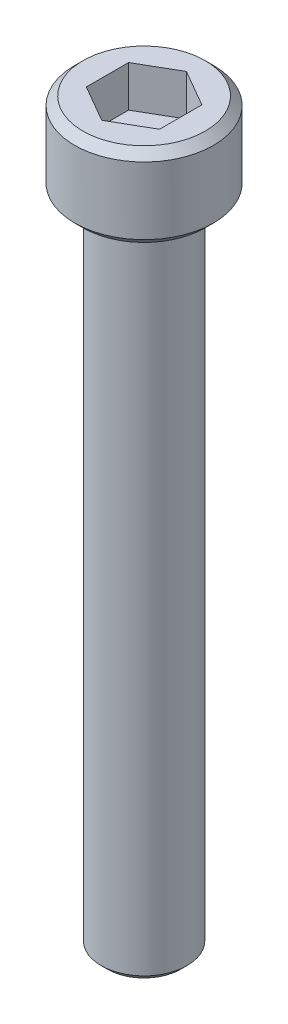
ISO-10303-21;
HEADER;
FILE_DESCRIPTION(('STEP AP214'),'2;1');
FILE_NAME('part.step','',(''),(''),'','','');
FILE_SCHEMA(('AUTOMOTIVE_DESIGN { 1 0 10303 214 1 1 1 1 }'));
ENDSEC;
DATA;
#1=APPLICATION_CONTEXT('core data for automotive mechanical design processes');
#2=APPLICATION_PROTOCOL_DEFINITION('international standard','automotive_design',2000,#1);
#3=PRODUCT_CONTEXT('',#1,'mechanical');
#4=PRODUCT('Part','Part','',(#3));
#5=PRODUCT_RELATED_PRODUCT_CATEGORY('part','',(#4));
#6=PRODUCT_DEFINITION_FORMATION('','',#4);
#7=PRODUCT_DEFINITION_CONTEXT('part definition',#1,'design');
#8=PRODUCT_DEFINITION('design','',#6,#7);
#9=PRODUCT_DEFINITION_SHAPE('','',#8);
#10=(LENGTH_UNIT() NAMED_UNIT(*) SI_UNIT(.MILLI.,.METRE.));
#11=(NAMED_UNIT(*) PLANE_ANGLE_UNIT() SI_UNIT($,.RADIAN.));
#12=(NAMED_UNIT(*) SI_UNIT($,.STERADIAN.) SOLID_ANGLE_UNIT());
#13=UNCERTAINTY_MEASURE_WITH_UNIT(LENGTH_MEASURE(1.E-05),#10,'distance_accuracy_value','');
#14=(GEOMETRIC_REPRESENTATION_CONTEXT(3) GLOBAL_UNCERTAINTY_ASSIGNED_CONTEXT((#13)) GLOBAL_UNIT_ASSIGNED_CONTEXT((#10,
#11,#12)) REPRESENTATION_CONTEXT('',''));
#15=CARTESIAN_POINT('',(0.,0.,0.));
#16=DIRECTION('',(0.,0.,1.));
#17=DIRECTION('',(1.,0.,0.));
#18=AXIS2_PLACEMENT_3D('',#15,#16,#17);
#19=CARTESIAN_POINT('',(1.778,2.06399999999999,3.07958633585746));
#20=DIRECTION('',(0.,1.,0.));
#21=DIRECTION('',(0.,0.,1.));
#22=AXIS2_PLACEMENT_3D('',#19,#20,#21);
#23=PLANE('',#22);
#24=DIRECTION('',(-0.866025403784439,0.,0.5));
#25=VECTOR('',#24,1.);
#26=CARTESIAN_POINT('',(0.,2.064,-2.05305755723831));
#27=LINE('',#26,#25);
#28=CARTESIAN_POINT('',(0.,2.06399999999999,-2.05305755723831));
#29=VERTEX_POINT('',#28);
#30=CARTESIAN_POINT('',(-1.778,2.06399999999999,-1.02652877861915));
#31=VERTEX_POINT('',#30);
#32=EDGE_CURVE('E68',#29,#31,#27,.T.);
#33=ORIENTED_EDGE('',*,*,#32,.T.);
#34=DIRECTION('',(0.,0.,1.));
#35=VECTOR('',#34,1.);
#36=CARTESIAN_POINT('',(-1.778,2.064,-1.02652877861915));
#37=LINE('',#36,#35);
#38=CARTESIAN_POINT('',(-1.778,2.06399999999999,1.02652877861915));
#39=VERTEX_POINT('',#38);
#40=EDGE_CURVE('E70',#31,#39,#37,.T.);
#41=ORIENTED_EDGE('',*,*,#40,.T.);
#42=DIRECTION('',(0.866025403784439,0.,0.499999999999999));
#43=VECTOR('',#42,1.);
#44=CARTESIAN_POINT('',(-1.778,2.064,1.02652877861915));
#45=LINE('',#44,#43);
#46=CARTESIAN_POINT('',(0.,2.06399999999999,2.05305755723831));
#47=VERTEX_POINT('',#46);
#48=EDGE_CURVE('E72',#39,#47,#45,.T.);
#49=ORIENTED_EDGE('',*,*,#48,.T.);
#50=DIRECTION('',(0.866025403784438,0.,-0.500000000000001));
#51=VECTOR('',#50,1.);
#52=CARTESIAN_POINT('',(0.,2.064,2.0530575572383));
#53=LINE('',#52,#51);
#54=CARTESIAN_POINT('',(1.778,2.06399999999999,1.02652877861915));
#55=VERTEX_POINT('',#54);
#56=EDGE_CURVE('E127',#47,#55,#53,.T.);
#57=ORIENTED_EDGE('',*,*,#56,.T.);
#58=DIRECTION('',(0.,0.,-1.));
#59=VECTOR('',#58,1.);
#60=CARTESIAN_POINT('',(1.778,2.06399999999999,1.02652877861915));
#61=LINE('',#60,#59);
#62=CARTESIAN_POINT('',(1.778,2.06399999999999,-1.02652877861916));
#63=VERTEX_POINT('',#62);
#64=EDGE_CURVE('E132',#55,#63,#61,.T.);
#65=ORIENTED_EDGE('',*,*,#64,.T.);
#66=DIRECTION('',(-0.866025403784439,0.,-0.499999999999999));
#67=VECTOR('',#66,1.);
#68=CARTESIAN_POINT('',(1.778,2.06399999999999,-1.02652877861916));
#69=LINE('',#68,#67);
#70=EDGE_CURVE('E136',#63,#29,#69,.T.);
#71=ORIENTED_EDGE('',*,*,#70,.T.);
#72=EDGE_LOOP('',(#33,#41,#49,#57,#65,#71));
#73=FACE_BOUND('',#72,.T.);
#74=ADVANCED_FACE('F17',(#73),#23,.T.);
#75=CARTESIAN_POINT('',(-1.778,2.064,1.02652877861915));
#76=DIRECTION('',(-0.499999999999999,0.,0.866025403784439));
#77=DIRECTION('',(0.866025403784439,0.,0.499999999999999));
#78=AXIS2_PLACEMENT_3D('',#75,#76,#77);
#79=PLANE('',#78);
#80=DIRECTION('',(0.,1.,0.));
#81=VECTOR('',#80,1.);
#82=CARTESIAN_POINT('',(0.,2.064,2.0530575572383));
#83=LINE('',#82,#81);
#84=CARTESIAN_POINT('',(0.,4.064,2.05305755723831));
#85=VERTEX_POINT('',#84);
#86=EDGE_CURVE('E83',#85,#47,#83,.F.);
#87=ORIENTED_EDGE('',*,*,#86,.T.);
#88=ORIENTED_EDGE('',*,*,#48,.F.);
#89=DIRECTION('',(0.,1.,0.));
#90=VECTOR('',#89,1.);
#91=CARTESIAN_POINT('',(-1.778,2.064,1.02652877861915));
#92=LINE('',#91,#90);
#93=CARTESIAN_POINT('',(-1.778,4.064,1.02652877861915));
#94=VERTEX_POINT('',#93);
#95=EDGE_CURVE('E77',#39,#94,#92,.T.);
#96=ORIENTED_EDGE('',*,*,#95,.T.);
#97=DIRECTION('',(-0.86602540378444,0.,-0.499999999999997));
#98=VECTOR('',#97,1.);
#99=CARTESIAN_POINT('',(0.,4.064,2.0530575572383));
#100=LINE('',#99,#98);
#101=EDGE_CURVE('E124',#85,#94,#100,.T.);
#102=ORIENTED_EDGE('',*,*,#101,.F.);
#103=EDGE_LOOP('',(#87,#88,#96,#102));
#104=FACE_BOUND('',#103,.T.);
#105=ADVANCED_FACE('F80',(#104),#79,.F.);
#106=CARTESIAN_POINT('',(-1.778,2.064,-1.02652877861915));
#107=DIRECTION('',(-1.,0.,0.));
#108=DIRECTION('',(0.,0.,1.));
#109=AXIS2_PLACEMENT_3D('',#106,#107,#108);
#110=PLANE('',#109);
#111=ORIENTED_EDGE('',*,*,#95,.F.);
#112=ORIENTED_EDGE('',*,*,#40,.F.);
#113=DIRECTION('',(0.,1.,0.));
#114=VECTOR('',#113,1.);
#115=CARTESIAN_POINT('',(-1.778,2.064,-1.02652877861915));
#116=LINE('',#115,#114);
#117=CARTESIAN_POINT('',(-1.778,4.064,-1.02652877861915));
#118=VERTEX_POINT('',#117);
#119=EDGE_CURVE('E91',#31,#118,#116,.T.);
#120=ORIENTED_EDGE('',*,*,#119,.T.);
#121=DIRECTION('',(0.,0.,1.));
#122=VECTOR('',#121,1.);
#123=CARTESIAN_POINT('',(-1.778,4.064,0.));
#124=LINE('',#123,#122);
#125=EDGE_CURVE('E88',#94,#118,#124,.F.);
#126=ORIENTED_EDGE('',*,*,#125,.F.);
#127=EDGE_LOOP('',(#111,#112,#120,#126));
#128=FACE_BOUND('',#127,.T.);
#129=ADVANCED_FACE('F86',(#128),#110,.F.);
#130=CARTESIAN_POINT('',(0.,2.064,-2.05305755723831));
#131=DIRECTION('',(-0.5,0.,-0.866025403784439));
#132=DIRECTION('',(-0.866025403784439,0.,0.5));
#133=AXIS2_PLACEMENT_3D('',#130,#131,#132);
#134=PLANE('',#133);
#135=ORIENTED_EDGE('',*,*,#119,.F.);
#136=ORIENTED_EDGE('',*,*,#32,.F.);
#137=DIRECTION('',(0.,1.,0.));
#138=VECTOR('',#137,1.);
#139=CARTESIAN_POINT('',(0.,2.06399999999999,-2.05305755723831));
#140=LINE('',#139,#138);
#141=CARTESIAN_POINT('',(0.,4.064,-2.05305755723831));
#142=VERTEX_POINT('',#141);
#143=EDGE_CURVE('E134',#29,#142,#140,.T.);
#144=ORIENTED_EDGE('',*,*,#143,.T.);
#145=DIRECTION('',(0.866025403784439,0.,-0.499999999999999));
#146=VECTOR('',#145,1.);
#147=CARTESIAN_POINT('',(-1.778,4.064,-1.02652877861915));
#148=LINE('',#147,#146);
#149=EDGE_CURVE('E120',#118,#142,#148,.T.);
#150=ORIENTED_EDGE('',*,*,#149,.F.);
#151=EDGE_LOOP('',(#135,#136,#144,#150));
#152=FACE_BOUND('',#151,.T.);
#153=ADVANCED_FACE('F139',(#152),#134,.F.);
#154=CARTESIAN_POINT('',(1.778,2.06399999999999,-1.02652877861916));
#155=DIRECTION('',(0.499999999999999,0.,-0.866025403784439));
#156=DIRECTION('',(-0.866025403784439,0.,-0.499999999999999));
#157=AXIS2_PLACEMENT_3D('',#154,#155,#156);
#158=PLANE('',#157);
#159=ORIENTED_EDGE('',*,*,#143,.F.);
#160=ORIENTED_EDGE('',*,*,#70,.F.);
#161=DIRECTION('',(0.,1.,0.));
#162=VECTOR('',#161,1.);
#163=CARTESIAN_POINT('',(1.778,2.06399999999999,-1.02652877861916));
#164=LINE('',#163,#162);
#165=CARTESIAN_POINT('',(1.778,4.064,-1.02652877861916));
#166=VERTEX_POINT('',#165);
#167=EDGE_CURVE('E130',#63,#166,#164,.T.);
#168=ORIENTED_EDGE('',*,*,#167,.T.);
#169=DIRECTION('',(0.86602540378444,0.,0.499999999999998));
#170=VECTOR('',#169,1.);
#171=CARTESIAN_POINT('',(0.,4.064,-2.05305755723831));
#172=LINE('',#171,#170);
#173=EDGE_CURVE('E117',#142,#166,#172,.T.);
#174=ORIENTED_EDGE('',*,*,#173,.F.);
#175=EDGE_LOOP('',(#159,#160,#168,#174));
#176=FACE_BOUND('',#175,.T.);
#177=ADVANCED_FACE('F151',(#176),#158,.F.);
#178=CARTESIAN_POINT('',(1.778,2.06399999999999,1.02652877861915));
#179=DIRECTION('',(1.,0.,0.));
#180=DIRECTION('',(0.,0.,-1.));
#181=AXIS2_PLACEMENT_3D('',#178,#179,#180);
#182=PLANE('',#181);
#183=ORIENTED_EDGE('',*,*,#167,.F.);
#184=ORIENTED_EDGE('',*,*,#64,.F.);
#185=DIRECTION('',(0.,1.,0.));
#186=VECTOR('',#185,1.);
#187=CARTESIAN_POINT('',(1.778,2.064,1.02652877861915));
#188=LINE('',#187,#186);
#189=CARTESIAN_POINT('',(1.778,4.06399999999999,1.02652877861915));
#190=VERTEX_POINT('',#189);
#191=EDGE_CURVE('E35',#55,#190,#188,.T.);
#192=ORIENTED_EDGE('',*,*,#191,.T.);
#193=DIRECTION('',(0.,0.,1.));
#194=VECTOR('',#193,1.);
#195=CARTESIAN_POINT('',(1.778,4.064,0.));
#196=LINE('',#195,#194);
#197=EDGE_CURVE('E114',#166,#190,#196,.T.);
#198=ORIENTED_EDGE('',*,*,#197,.F.);
#199=EDGE_LOOP('',(#183,#184,#192,#198));
#200=FACE_BOUND('',#199,.T.);
#201=ADVANCED_FACE('F149',(#200),#182,.F.);
#202=CARTESIAN_POINT('',(0.,2.064,2.0530575572383));
#203=DIRECTION('',(0.500000000000001,0.,0.866025403784438));
#204=DIRECTION('',(0.866025403784438,0.,-0.500000000000001));
#205=AXIS2_PLACEMENT_3D('',#202,#203,#204);
#206=PLANE('',#205);
#207=ORIENTED_EDGE('',*,*,#191,.F.);
#208=ORIENTED_EDGE('',*,*,#56,.F.);
#209=ORIENTED_EDGE('',*,*,#86,.F.);
#210=DIRECTION('',(-0.866025403784439,0.,0.5));
#211=VECTOR('',#210,1.);
#212=CARTESIAN_POINT('',(1.778,4.064,1.02652877861915));
#213=LINE('',#212,#211);
#214=EDGE_CURVE('E111',#190,#85,#213,.T.);
#215=ORIENTED_EDGE('',*,*,#214,.F.);
#216=EDGE_LOOP('',(#207,#208,#209,#215));
#217=FACE_BOUND('',#216,.T.);
#218=ADVANCED_FACE('F146',(#217),#206,.F.);
#219=CARTESIAN_POINT('',(0.,4.064,0.));
#220=DIRECTION('',(0.,1.,0.));
#221=DIRECTION('',(0.,0.,1.));
#222=AXIS2_PLACEMENT_3D('',#219,#220,#221);
#223=PLANE('',#222);
#224=ORIENTED_EDGE('',*,*,#197,.T.);
#225=ORIENTED_EDGE('',*,*,#214,.T.);
#226=ORIENTED_EDGE('',*,*,#101,.T.);
#227=ORIENTED_EDGE('',*,*,#125,.T.);
#228=ORIENTED_EDGE('',*,*,#149,.T.);
#229=ORIENTED_EDGE('',*,*,#173,.T.);
#230=EDGE_LOOP('',(#224,#225,#226,#227,#228,#229));
#231=FACE_BOUND('',#230,.T.);
#232=CARTESIAN_POINT('',(0.,4.06400000002805,0.));
#233=DIRECTION('',(0.,-1.,0.));
#234=DIRECTION('',(1.,0.,0.));
#235=AXIS2_PLACEMENT_3D('',#232,#233,#234);
#236=CIRCLE('',#235,2.96550000001616);
#237=CARTESIAN_POINT('',(2.96550000001616,4.06400000002805,0.));
#238=VERTEX_POINT('',#237);
#239=EDGE_CURVE('E20',#238,#238,#236,.T.);
#240=ORIENTED_EDGE('',*,*,#239,.F.);
#241=EDGE_LOOP('',(#240));
#242=FACE_BOUND('',#241,.T.);
#243=ADVANCED_FACE('F143',(#231,#242),#223,.T.);
#244=CARTESIAN_POINT('',(0.,3.66400000007161,0.));
#245=DIRECTION('',(0.,-1.,0.));
#246=DIRECTION('',(1.,0.,0.));
#247=AXIS2_PLACEMENT_3D('',#244,#245,#246);
#248=CONICAL_SURFACE('',#247,3.36550000002944,0.785398163468503);
#249=ORIENTED_EDGE('',*,*,#239,.T.);
#250=EDGE_LOOP('',(#249));
#251=FACE_BOUND('',#250,.T.);
#252=CARTESIAN_POINT('',(0.,3.66399999999999,0.));
#253=DIRECTION('',(0.,-1.,0.));
#254=DIRECTION('',(0.,0.,-1.));
#255=AXIS2_PLACEMENT_3D('',#252,#253,#254);
#256=CIRCLE('',#255,3.3655);
#257=CARTESIAN_POINT('',(0.,3.66399999999999,-3.3655));
#258=VERTEX_POINT('',#257);
#259=EDGE_CURVE('E103',#258,#258,#256,.T.);
#260=ORIENTED_EDGE('',*,*,#259,.F.);
#261=EDGE_LOOP('',(#260));
#262=FACE_BOUND('',#261,.T.);
#263=ADVANCED_FACE('F188',(#251,#262),#248,.T.);
#264=CARTESIAN_POINT('',(0.,4.064,0.));
#265=DIRECTION('',(0.,-1.,0.));
#266=DIRECTION('',(0.,0.,-1.));
#267=AXIS2_PLACEMENT_3D('',#264,#265,#266);
#268=CYLINDRICAL_SURFACE('',#267,3.3655);
#269=ORIENTED_EDGE('',*,*,#259,.T.);
#270=EDGE_LOOP('',(#269));
#271=FACE_BOUND('',#270,.T.);
#272=CARTESIAN_POINT('',(0.,0.400000000013279,0.));
#273=DIRECTION('',(0.,1.,0.));
#274=DIRECTION('',(0.,0.,1.));
#275=AXIS2_PLACEMENT_3D('',#272,#273,#274);
#276=CIRCLE('',#275,3.3654999999726);
#277=CARTESIAN_POINT('',(0.,0.400000000013279,3.3654999999726));
#278=VERTEX_POINT('',#277);
#279=EDGE_CURVE('E99',#278,#278,#276,.F.);
#280=ORIENTED_EDGE('',*,*,#279,.F.);
#281=EDGE_LOOP('',(#280));
#282=FACE_BOUND('',#281,.T.);
#283=ADVANCED_FACE('F184',(#271,#282),#268,.T.);
#284=CARTESIAN_POINT('',(0.,-31.75,0.));
#285=DIRECTION('',(0.,1.,0.));
#286=DIRECTION('',(0.,0.,1.));
#287=AXIS2_PLACEMENT_3D('',#284,#285,#286);
#288=PLANE('',#287);
#289=CARTESIAN_POINT('',(0.,-31.7499999999882,0.));
#290=DIRECTION('',(0.,1.,0.));
#291=DIRECTION('',(0.,0.,1.));
#292=AXIS2_PLACEMENT_3D('',#289,#290,#291);
#293=CIRCLE('',#292,1.78280000000086);
#294=CARTESIAN_POINT('',(0.,-31.7499999999882,1.78280000000086));
#295=VERTEX_POINT('',#294);
#296=EDGE_CURVE('E97',#295,#295,#293,.T.);
#297=ORIENTED_EDGE('',*,*,#296,.F.);
#298=EDGE_LOOP('',(#297));
#299=FACE_BOUND('',#298,.T.);
#300=ADVANCED_FACE('F180',(#299),#288,.F.);
#301=CARTESIAN_POINT('',(0.,0.400000000013279,0.));
#302=DIRECTION('',(0.,1.,0.));
#303=DIRECTION('',(0.,0.,1.));
#304=AXIS2_PLACEMENT_3D('',#301,#302,#303);
#305=CONICAL_SURFACE('',#304,3.3654999999726,0.785398163397448);
#306=CARTESIAN_POINT('',(0.,0.,0.));
#307=DIRECTION('',(0.,1.,0.));
#308=DIRECTION('',(0.,0.,1.));
#309=AXIS2_PLACEMENT_3D('',#306,#307,#308);
#310=CIRCLE('',#309,2.96549999995932);
#311=CARTESIAN_POINT('',(0.,0.,2.96549999995932));
#312=VERTEX_POINT('',#311);
#313=EDGE_CURVE('E95',#312,#312,#310,.T.);
#314=ORIENTED_EDGE('',*,*,#313,.T.);
#315=EDGE_LOOP('',(#314));
#316=FACE_BOUND('',#315,.T.);
#317=ORIENTED_EDGE('',*,*,#279,.T.);
#318=EDGE_LOOP('',(#317));
#319=FACE_BOUND('',#318,.T.);
#320=ADVANCED_FACE('F176',(#316,#319),#305,.T.);
#321=CARTESIAN_POINT('',(0.,-31.4500000001203,0.));
#322=DIRECTION('',(0.,1.,0.));
#323=DIRECTION('',(0.,0.,1.));
#324=AXIS2_PLACEMENT_3D('',#321,#322,#323);
#325=CONICAL_SURFACE('',#324,2.08279999986871,0.785398163397448);
#326=CARTESIAN_POINT('',(0.,-31.45,0.));
#327=DIRECTION('',(0.,1.,0.));
#328=DIRECTION('',(0.,0.,1.));
#329=AXIS2_PLACEMENT_3D('',#326,#327,#328);
#330=CIRCLE('',#329,2.0828);
#331=CARTESIAN_POINT('',(0.,-31.45,2.0828));
#332=VERTEX_POINT('',#331);
#333=EDGE_CURVE('E26',#332,#332,#330,.T.);
#334=ORIENTED_EDGE('',*,*,#333,.F.);
#335=EDGE_LOOP('',(#334));
#336=FACE_BOUND('',#335,.T.);
#337=ORIENTED_EDGE('',*,*,#296,.T.);
#338=EDGE_LOOP('',(#337));
#339=FACE_BOUND('',#338,.T.);
#340=ADVANCED_FACE('F169',(#336,#339),#325,.T.);
#341=CARTESIAN_POINT('',(0.,0.,0.));
#342=DIRECTION('',(0.,1.,0.));
#343=DIRECTION('',(0.,0.,1.));
#344=AXIS2_PLACEMENT_3D('',#341,#342,#343);
#345=PLANE('',#344);
#346=CARTESIAN_POINT('',(0.,0.,0.));
#347=DIRECTION('',(0.,1.,0.));
#348=DIRECTION('',(0.,0.,1.));
#349=AXIS2_PLACEMENT_3D('',#346,#347,#348);
#350=CIRCLE('',#349,2.0828);
#351=CARTESIAN_POINT('',(0.,0.,2.0828));
#352=VERTEX_POINT('',#351);
#353=EDGE_CURVE('E11',#352,#352,#350,.F.);
#354=ORIENTED_EDGE('',*,*,#353,.F.);
#355=EDGE_LOOP('',(#354));
#356=FACE_BOUND('',#355,.T.);
#357=ORIENTED_EDGE('',*,*,#313,.F.);
#358=EDGE_LOOP('',(#357));
#359=FACE_BOUND('',#358,.T.);
#360=ADVANCED_FACE('F163',(#356,#359),#345,.F.);
#361=CARTESIAN_POINT('',(0.,-31.75,0.));
#362=DIRECTION('',(0.,1.,0.));
#363=DIRECTION('',(0.,0.,1.));
#364=AXIS2_PLACEMENT_3D('',#361,#362,#363);
#365=CYLINDRICAL_SURFACE('',#364,2.0828);
#366=ORIENTED_EDGE('',*,*,#353,.T.);
#367=EDGE_LOOP('',(#366));
#368=FACE_BOUND('',#367,.T.);
#369=ORIENTED_EDGE('',*,*,#333,.T.);
#370=EDGE_LOOP('',(#369));
#371=FACE_BOUND('',#370,.T.);
#372=ADVANCED_FACE('F161',(#368,#371),#365,.T.);
#373=CLOSED_SHELL('',(#74,#105,#129,#153,#177,#201,#218,#243,#263,#283,#300,#320,#340,#360,#372));
#374=MANIFOLD_SOLID_BREP('B1',#373);
#375=ADVANCED_BREP_SHAPE_REPRESENTATION('',(#18,#374),#14);
#376=SHAPE_DEFINITION_REPRESENTATION(#9,#375);
ENDSEC;
END-ISO-10303-21;
